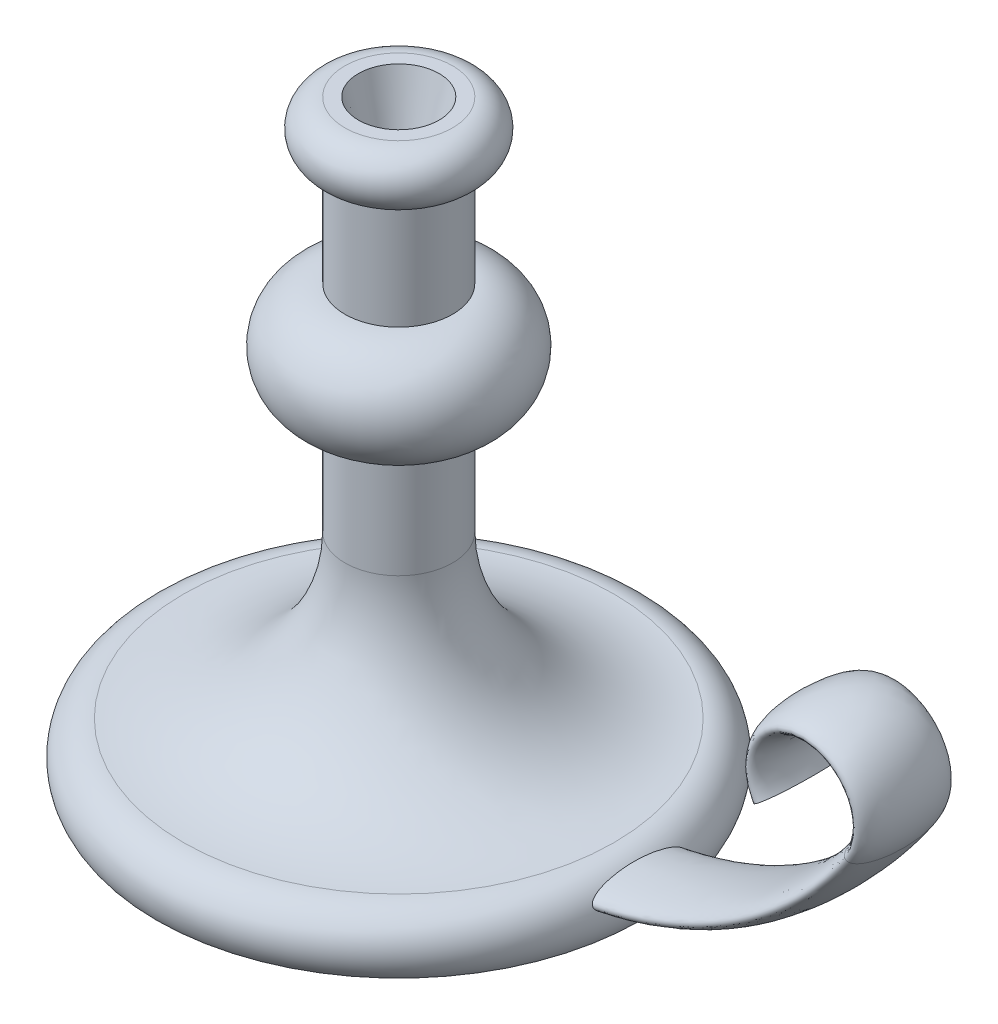
ISO-10303-21;
HEADER;
FILE_DESCRIPTION(('STEP AP214'),'2;1');
FILE_NAME('part.step','',(''),(''),'','','');
FILE_SCHEMA(('AUTOMOTIVE_DESIGN { 1 0 10303 214 1 1 1 1 }'));
ENDSEC;
DATA;
#1=APPLICATION_CONTEXT('core data for automotive mechanical design processes');
#2=APPLICATION_PROTOCOL_DEFINITION('international standard','automotive_design',2000,#1);
#3=PRODUCT_CONTEXT('',#1,'mechanical');
#4=PRODUCT('Part','Part','',(#3));
#5=PRODUCT_RELATED_PRODUCT_CATEGORY('part','',(#4));
#6=PRODUCT_DEFINITION_FORMATION('','',#4);
#7=PRODUCT_DEFINITION_CONTEXT('part definition',#1,'design');
#8=PRODUCT_DEFINITION('design','',#6,#7);
#9=PRODUCT_DEFINITION_SHAPE('','',#8);
#10=(LENGTH_UNIT() NAMED_UNIT(*) SI_UNIT(.MILLI.,.METRE.));
#11=(NAMED_UNIT(*) PLANE_ANGLE_UNIT() SI_UNIT($,.RADIAN.));
#12=(NAMED_UNIT(*) SI_UNIT($,.STERADIAN.) SOLID_ANGLE_UNIT());
#13=UNCERTAINTY_MEASURE_WITH_UNIT(LENGTH_MEASURE(1.E-05),#10,'distance_accuracy_value','');
#14=(GEOMETRIC_REPRESENTATION_CONTEXT(3) GLOBAL_UNCERTAINTY_ASSIGNED_CONTEXT((#13)) GLOBAL_UNIT_ASSIGNED_CONTEXT((#10,
#11,#12)) REPRESENTATION_CONTEXT('',''));
#15=CARTESIAN_POINT('',(0.,0.,0.));
#16=DIRECTION('',(0.,0.,1.));
#17=DIRECTION('',(1.,0.,0.));
#18=AXIS2_PLACEMENT_3D('',#15,#16,#17);
#19=CARTESIAN_POINT('',(0.,58.5,0.));
#20=DIRECTION('',(0.,1.,0.));
#21=DIRECTION('',(-1.,0.,0.));
#22=AXIS2_PLACEMENT_3D('',#19,#20,#21);
#23=TOROIDAL_SURFACE('',#22,20.,10.);
#24=CARTESIAN_POINT('',(0.,68.5,0.));
#25=DIRECTION('',(0.,1.,0.));
#26=DIRECTION('',(-1.,0.,0.));
#27=AXIS2_PLACEMENT_3D('',#24,#25,#26);
#28=CIRCLE('',#27,20.);
#29=CARTESIAN_POINT('',(-20.,68.5,0.));
#30=VERTEX_POINT('',#29);
#31=EDGE_CURVE('E11',#30,#30,#28,.T.);
#32=ORIENTED_EDGE('',*,*,#31,.F.);
#33=EDGE_LOOP('',(#32));
#34=FACE_BOUND('',#33,.T.);
#35=CARTESIAN_POINT('',(0.,48.5,0.));
#36=DIRECTION('',(0.,1.,0.));
#37=DIRECTION('',(-1.,0.,0.));
#38=AXIS2_PLACEMENT_3D('',#35,#36,#37);
#39=CIRCLE('',#38,20.);
#40=CARTESIAN_POINT('',(-20.,48.5,0.));
#41=VERTEX_POINT('',#40);
#42=EDGE_CURVE('E58',#41,#41,#39,.T.);
#43=ORIENTED_EDGE('',*,*,#42,.T.);
#44=EDGE_LOOP('',(#43));
#45=FACE_BOUND('',#44,.T.);
#46=ADVANCED_FACE('F37',(#34,#45),#23,.T.);
#47=CARTESIAN_POINT('',(20.,68.5,0.));
#48=DIRECTION('',(0.,-1.,0.));
#49=DIRECTION('',(1.,0.,0.));
#50=AXIS2_PLACEMENT_3D('',#47,#48,#49);
#51=PLANE('',#50);
#52=CARTESIAN_POINT('',(0.,68.5,0.));
#53=DIRECTION('',(0.,1.,0.));
#54=DIRECTION('',(-1.,0.,0.));
#55=AXIS2_PLACEMENT_3D('',#52,#53,#54);
#56=CIRCLE('',#55,15.);
#57=CARTESIAN_POINT('',(-15.,68.5,0.));
#58=VERTEX_POINT('',#57);
#59=EDGE_CURVE('E164',#58,#58,#56,.T.);
#60=ORIENTED_EDGE('',*,*,#59,.F.);
#61=EDGE_LOOP('',(#60));
#62=FACE_BOUND('',#61,.T.);
#63=ORIENTED_EDGE('',*,*,#31,.T.);
#64=EDGE_LOOP('',(#63));
#65=FACE_BOUND('',#64,.T.);
#66=ADVANCED_FACE('F86',(#62,#65),#51,.F.);
#67=CARTESIAN_POINT('',(0.,-151.5,0.));
#68=DIRECTION('',(0.,1.,0.));
#69=DIRECTION('',(-1.,0.,0.));
#70=AXIS2_PLACEMENT_3D('',#67,#68,#69);
#71=PLANE('',#70);
#72=CARTESIAN_POINT('',(0.,-151.5,0.));
#73=DIRECTION('',(0.,1.,0.));
#74=DIRECTION('',(-1.,0.,0.));
#75=AXIS2_PLACEMENT_3D('',#72,#73,#74);
#76=CIRCLE('',#75,90.);
#77=CARTESIAN_POINT('',(-90.,-151.5,0.));
#78=VERTEX_POINT('',#77);
#79=EDGE_CURVE('E48',#78,#78,#76,.T.);
#80=ORIENTED_EDGE('',*,*,#79,.F.);
#81=EDGE_LOOP('',(#80));
#82=FACE_BOUND('',#81,.T.);
#83=ADVANCED_FACE('F84',(#82),#71,.F.);
#84=CARTESIAN_POINT('',(0.,-144.,0.));
#85=DIRECTION('',(0.,1.,0.));
#86=DIRECTION('',(-1.,0.,0.));
#87=AXIS2_PLACEMENT_3D('',#84,#85,#86);
#88=TOROIDAL_SURFACE('',#87,80.,12.5);
#89=CARTESIAN_POINT('',(89.5597422043341,-138.558565343244,-17.5));
#90=CARTESIAN_POINT('',(89.5807278946485,-138.601160684292,-17.5000019534777));
#91=CARTESIAN_POINT('',(89.6018125795404,-138.643696064223,-17.4977816975197));
#92=CARTESIAN_POINT('',(89.6440155813562,-138.728306166063,-17.489002543543));
#93=CARTESIAN_POINT('',(89.6651339056646,-138.770380763928,-17.4824425050804));
#94=CARTESIAN_POINT('',(89.7283289297819,-138.895492340258,-17.4565216692095));
#95=CARTESIAN_POINT('',(89.7702246464785,-138.977374410574,-17.4309204730636));
#96=CARTESIAN_POINT('',(89.8644276523311,-139.159226422803,-17.3563532007827));
#97=CARTESIAN_POINT('',(89.9162117483189,-139.257515098334,-17.3027527423027));
#98=CARTESIAN_POINT('',(90.0163878681401,-139.444854172799,-17.178826321144));
#99=CARTESIAN_POINT('',(90.0647710548456,-139.533880773007,-17.1084587296403));
#100=CARTESIAN_POINT('',(90.1524531790238,-139.693015477075,-16.9652391551481));
#101=CARTESIAN_POINT('',(90.1921458014336,-139.764112100552,-16.8936963434586));
#102=CARTESIAN_POINT('',(90.2690886261224,-139.900374093178,-16.7438969488311));
#103=CARTESIAN_POINT('',(90.3063367280021,-139.965534379847,-16.665634722265));
#104=CARTESIAN_POINT('',(90.3786756485819,-140.090745918489,-16.5039763875564));
#105=CARTESIAN_POINT('',(90.4137624747614,-140.150787789371,-16.4205713158718));
#106=CARTESIAN_POINT('',(90.4819450166471,-140.26631059746,-16.2499454917114));
#107=CARTESIAN_POINT('',(90.5150413047902,-140.321792847617,-16.162725848809));
#108=CARTESIAN_POINT('',(90.5839705930101,-140.436274817431,-15.9728919395737));
#109=CARTESIAN_POINT('',(90.6195406839562,-140.494684387115,-15.8698282905888));
#110=CARTESIAN_POINT('',(90.6886668526269,-140.607085610279,-15.6606649910659));
#111=CARTESIAN_POINT('',(90.7222226971282,-140.661076752426,-15.5545649910506));
#112=CARTESIAN_POINT('',(90.787486486134,-140.765124859688,-15.3401290691865));
#113=CARTESIAN_POINT('',(90.8191972688173,-140.815187910916,-15.2317969483067));
#114=CARTESIAN_POINT('',(90.881005962979,-140.911931661459,-15.0131968985225));
#115=CARTESIAN_POINT('',(90.9111039714558,-140.958612564248,-14.9029290865687));
#116=CARTESIAN_POINT('',(90.9798973633521,-141.06445084829,-14.6427529331226));
#117=CARTESIAN_POINT('',(91.0180072010884,-141.122406334424,-14.4922012075481));
#118=CARTESIAN_POINT('',(91.0918875553169,-141.233653710831,-14.1888070722871));
#119=CARTESIAN_POINT('',(91.1276577411367,-141.286944942244,-14.0359643425398));
#120=CARTESIAN_POINT('',(91.1971197458645,-141.389487231039,-13.7282685712582));
#121=CARTESIAN_POINT('',(91.2308091946811,-141.43873370149,-13.5734134718711));
#122=CARTESIAN_POINT('',(91.2962483962878,-141.533579554252,-13.262180104172));
#123=CARTESIAN_POINT('',(91.3279980241889,-141.5791787018,-13.1058017385397));
#124=CARTESIAN_POINT('',(91.4205951755327,-141.711125413392,-12.6346162266686));
#125=CARTESIAN_POINT('',(91.4787589060981,-141.792575230204,-12.3179025042443));
#126=CARTESIAN_POINT('',(91.5890957852254,-141.945061738698,-11.6792188898602));
#127=CARTESIAN_POINT('',(91.641236506382,-142.016042585741,-11.357230318611));
#128=CARTESIAN_POINT('',(91.7397682682944,-142.148637788368,-10.7107316640824));
#129=CARTESIAN_POINT('',(91.7861636672357,-142.210259251768,-10.3862236929835));
#130=CARTESIAN_POINT('',(91.8736976604511,-142.325362816819,-9.73512886653582));
#131=CARTESIAN_POINT('',(91.9148370779327,-142.378846193335,-9.40854234516828));
#132=CARTESIAN_POINT('',(91.9930777751443,-142.479687900797,-8.74630339912627));
#133=CARTESIAN_POINT('',(92.0300669877613,-142.526880788628,-8.4106126926435));
#134=CARTESIAN_POINT('',(92.0991833927575,-142.614401575226,-7.73783252743958));
#135=CARTESIAN_POINT('',(92.1313104056235,-142.654729220532,-7.40074301754625));
#136=CARTESIAN_POINT('',(92.1909161961866,-142.729076865607,-6.72537142355359));
#137=CARTESIAN_POINT('',(92.2183937480206,-142.763095202108,-6.38708904887205));
#138=CARTESIAN_POINT('',(92.2688480816039,-142.825231596955,-5.70964427774304));
#139=CARTESIAN_POINT('',(92.2918247141674,-142.853349459728,-5.37048185250312));
#140=CARTESIAN_POINT('',(92.3540877228587,-142.929233953695,-4.35367181244682));
#141=CARTESIAN_POINT('',(92.3868571977359,-142.968716616294,-3.67498389641661));
#142=CARTESIAN_POINT('',(92.4356134743347,-143.027258381671,-2.31614711504086));
#143=CARTESIAN_POINT('',(92.4515998737813,-143.046316994903,-1.6359982150684));
#144=CARTESIAN_POINT('',(92.4661200478781,-143.063626607151,-0.357955102332095));
#145=CARTESIAN_POINT('',(92.4665389208555,-143.064125098203,0.239888856143528));
#146=CARTESIAN_POINT('',(92.4546362797529,-143.049937587392,1.43536153859156));
#147=CARTESIAN_POINT('',(92.4423128974783,-143.035249358942,2.03299021814836));
#148=CARTESIAN_POINT('',(92.4047541650815,-142.990233192201,3.22745109478542));
#149=CARTESIAN_POINT('',(92.379514731688,-142.959900307996,3.82428298010725));
#150=CARTESIAN_POINT('',(92.3157217367253,-142.882566797703,5.01694606233267));
#151=CARTESIAN_POINT('',(92.2771508465328,-142.835544476041,5.61277493756139));
#152=CARTESIAN_POINT('',(92.1861026743767,-142.723212157537,6.80153886380954));
#153=CARTESIAN_POINT('',(92.1336290020919,-142.657906907375,7.39447462535108));
#154=CARTESIAN_POINT('',(92.0437550848418,-142.544257727933,8.28055229820534));
#155=CARTESIAN_POINT('',(92.0119455213755,-142.50377105448,8.57528682166749));
#156=CARTESIAN_POINT('',(91.9444204496405,-142.417084602051,9.1634609442891));
#157=CARTESIAN_POINT('',(91.9087051114865,-142.370885071885,9.45690059926742));
#158=CARTESIAN_POINT('',(91.8331309715697,-142.272170706659,10.0422906036686));
#159=CARTESIAN_POINT('',(91.7932707518514,-142.219653709436,10.3342404073471));
#160=CARTESIAN_POINT('',(91.7091179167369,-142.107549379184,10.9161852811056));
#161=CARTESIAN_POINT('',(91.6648247441272,-142.04796115714,11.2061801005456));
#162=CARTESIAN_POINT('',(91.571392572748,-141.920683546661,11.7838191658172));
#163=CARTESIAN_POINT('',(91.5222504482681,-141.852988926631,12.0714617643076));
#164=CARTESIAN_POINT('',(91.4186796874405,-141.708272699141,12.6430805537635));
#165=CARTESIAN_POINT('',(91.3642572573634,-141.631262015759,12.9270606150359));
#166=CARTESIAN_POINT('',(91.2493765391174,-141.466047025212,13.490421718147));
#167=CARTESIAN_POINT('',(91.1889212109096,-141.377848201655,13.7698049377452));
#168=CARTESIAN_POINT('',(91.0929373870873,-141.235172511764,14.1839125047651));
#169=CARTESIAN_POINT('',(91.0600757486261,-141.185909581815,14.3210581267391));
#170=CARTESIAN_POINT('',(90.9923938569385,-141.083448897281,14.5933763477653));
#171=CARTESIAN_POINT('',(90.9575737807135,-141.030251498152,14.7285491237349));
#172=CARTESIAN_POINT('',(90.8810851838776,-140.912154865592,15.0138774923682));
#173=CARTESIAN_POINT('',(90.8391147723956,-140.846633379159,15.1636969104752));
#174=CARTESIAN_POINT('',(90.7519625692611,-140.708781022818,15.4593295355903));
#175=CARTESIAN_POINT('',(90.7067794219568,-140.636447274169,15.6051410149851));
#176=CARTESIAN_POINT('',(90.6128939496974,-140.483956037032,15.8905749729624));
#177=CARTESIAN_POINT('',(90.564208454431,-140.403835389431,16.0302224467126));
#178=CARTESIAN_POINT('',(90.4624897667354,-140.233746989213,16.3016394850687));
#179=CARTESIAN_POINT('',(90.4094613083908,-140.143789923932,16.4334173639363));
#180=CARTESIAN_POINT('',(90.3114276481006,-139.974491461495,16.6553108138958));
#181=CARTESIAN_POINT('',(90.2675273757818,-139.897739110939,16.7478644471359));
#182=CARTESIAN_POINT('',(90.1761749534326,-139.735670776131,16.9236630994732));
#183=CARTESIAN_POINT('',(90.1287172073378,-139.650341224507,17.0068929161981));
#184=CARTESIAN_POINT('',(90.0292807633426,-139.468670820263,17.160728121925));
#185=CARTESIAN_POINT('',(89.9772518064337,-139.372202559265,17.2311575389092));
#186=CARTESIAN_POINT('',(89.8965437818878,-139.219938601206,17.3212876850736));
#187=CARTESIAN_POINT('',(89.8692277989252,-139.167983584686,17.3487242132162));
#188=CARTESIAN_POINT('',(89.8138320311431,-139.061704483152,17.397521114568));
#189=CARTESIAN_POINT('',(89.7857527202502,-139.00738185602,17.4188851676711));
#190=CARTESIAN_POINT('',(89.7185869780335,-138.87629519944,17.4611772226903));
#191=CARTESIAN_POINT('',(89.6792533408886,-138.798630777572,17.4790502108364));
#192=CARTESIAN_POINT('',(89.6005512815563,-138.641374366051,17.4997317533413));
#193=CARTESIAN_POINT('',(89.5611829132232,-138.561783986005,17.5025524785485));
#194=CARTESIAN_POINT('',(89.4835317885696,-138.403036657675,17.4927372657774));
#195=CARTESIAN_POINT('',(89.4452490812936,-138.323879729103,17.48010063065));
#196=CARTESIAN_POINT('',(89.3707047667354,-138.168192822544,17.440649407729));
#197=CARTESIAN_POINT('',(89.3344452993771,-138.091665657647,17.4138201116179));
#198=CARTESIAN_POINT('',(89.2510611220234,-137.914144561432,17.3357126521072));
#199=CARTESIAN_POINT('',(89.2050998650831,-137.815017622278,17.279004762084));
#200=CARTESIAN_POINT('',(89.1180744174556,-137.625572368818,17.1491670423825));
#201=CARTESIAN_POINT('',(89.0770301058258,-137.535290064331,17.0759737821297));
#202=CARTESIAN_POINT('',(89.003703374471,-137.372856514243,16.9270577307037));
#203=CARTESIAN_POINT('',(88.9709541551902,-137.299805431927,16.8525208708984));
#204=CARTESIAN_POINT('',(88.9084968426189,-137.159818830955,16.6970292692108));
#205=CARTESIAN_POINT('',(88.8787841266133,-137.092874033423,16.616084626189));
#206=CARTESIAN_POINT('',(88.8217814388548,-136.964000436911,16.4490709627675));
#207=CARTESIAN_POINT('',(88.7944998605825,-136.902089075759,16.3629857823207));
#208=CARTESIAN_POINT('',(88.7420667437368,-136.782826593534,16.1870697873627));
#209=CARTESIAN_POINT('',(88.7169159331091,-136.72547703134,16.0972377082946));
#210=CARTESIAN_POINT('',(88.6682699235335,-136.614410090948,15.9140699306458));
#211=CARTESIAN_POINT('',(88.6447869137155,-136.560719551057,15.8207148279054));
#212=CARTESIAN_POINT('',(88.5993971939426,-136.456899115611,15.6316626961427));
#213=CARTESIAN_POINT('',(88.5774907604156,-136.40676984449,15.5359652603518));
#214=CARTESIAN_POINT('',(88.5137514786218,-136.260971412581,15.245806244878));
#215=CARTESIAN_POINT('',(88.4739596847911,-136.170031452264,15.048514720784));
#216=CARTESIAN_POINT('',(88.3985337506613,-135.998222479637,14.6487152633379));
#217=CARTESIAN_POINT('',(88.3629029634838,-135.917361585996,14.4462032813464));
#218=CARTESIAN_POINT('',(88.294835671121,-135.763693387132,14.0365764701678));
#219=CARTESIAN_POINT('',(88.2624142295167,-135.690923880018,13.8294450545338));
#220=CARTESIAN_POINT('',(88.2003835751379,-135.552635119804,13.4126289871747));
#221=CARTESIAN_POINT('',(88.1707714189811,-135.487108266177,13.2029472733568));
#222=CARTESIAN_POINT('',(88.1139049361935,-135.362262425437,12.7814949946285));
#223=CARTESIAN_POINT('',(88.0866500408506,-135.302941940249,12.5697249473611));
#224=CARTESIAN_POINT('',(88.0276172572028,-135.175576433769,12.0912931700759));
#225=CARTESIAN_POINT('',(87.9964138193042,-135.10906187345,11.8241540502324));
#226=CARTESIAN_POINT('',(87.9367717636615,-134.983406323528,11.2878278414627));
#227=CARTESIAN_POINT('',(87.9083334164419,-134.924266055233,11.018640554925));
#228=CARTESIAN_POINT('',(87.853926628297,-134.812490105104,10.4785408424857));
#229=CARTESIAN_POINT('',(87.8279593730485,-134.7598575422,10.2076276543167));
#230=CARTESIAN_POINT('',(87.7783184309329,-134.660469847706,9.66451167999545));
#231=CARTESIAN_POINT('',(87.7546448506394,-134.613714989188,9.39230883453631));
#232=CARTESIAN_POINT('',(87.6869994555323,-134.481719694905,8.57578965921468));
#233=CARTESIAN_POINT('',(87.6462388525844,-134.404414599631,8.02991167225116));
#234=CARTESIAN_POINT('',(87.5728065515609,-134.267985431269,6.93552385093627));
#235=CARTESIAN_POINT('',(87.540133067568,-134.208857343367,6.38701462497697));
#236=CARTESIAN_POINT('',(87.4828441952969,-134.106912387902,5.28955884850476));
#237=CARTESIAN_POINT('',(87.4582074588679,-134.064052257067,4.74061740412112));
#238=CARTESIAN_POINT('',(87.416941099917,-133.99311150653,3.64146108218268));
#239=CARTESIAN_POINT('',(87.4003119088601,-133.965031683216,3.09124613761343));
#240=CARTESIAN_POINT('',(87.3751699481988,-133.922843353797,1.9898086896874));
#241=CARTESIAN_POINT('',(87.3666614689743,-133.908742232847,1.43858580771637));
#242=CARTESIAN_POINT('',(87.3578539704596,-133.89414881594,0.335909067640385));
#243=CARTESIAN_POINT('',(87.3575547550008,-133.893656194796,-0.215544784630398));
#244=CARTESIAN_POINT('',(87.3651677510509,-133.906264783749,-1.3181582277678));
#245=CARTESIAN_POINT('',(87.3730787250644,-133.919363945201,-1.86931785045645));
#246=CARTESIAN_POINT('',(87.3970372477744,-133.959513170726,-2.97097544678305));
#247=CARTESIAN_POINT('',(87.413085065354,-133.986563695824,-3.52147339795334));
#248=CARTESIAN_POINT('',(87.4531996813084,-134.055378617243,-4.62112135667417));
#249=CARTESIAN_POINT('',(87.4772644593795,-134.097139306699,-5.17027166874783));
#250=CARTESIAN_POINT('',(87.5333316774065,-134.196629238728,-6.26670053624201));
#251=CARTESIAN_POINT('',(87.5653334299487,-134.254357098449,-6.81397924960065));
#252=CARTESIAN_POINT('',(87.6208220531236,-134.357095049092,-7.65503321384444));
#253=CARTESIAN_POINT('',(87.6414679669265,-134.395766675327,-7.94978028809553));
#254=CARTESIAN_POINT('',(87.6851649593461,-134.478774929846,-8.53829462762855));
#255=CARTESIAN_POINT('',(87.7082159678756,-134.523111393058,-8.83206192120513));
#256=CARTESIAN_POINT('',(87.7568106691343,-134.617948963033,-9.41827197237469));
#257=CARTESIAN_POINT('',(87.7823533406007,-134.668447546227,-9.71071522165399));
#258=CARTESIAN_POINT('',(87.8360989952271,-134.776280631896,-10.2940938312804));
#259=CARTESIAN_POINT('',(87.8643018909562,-134.833614909727,-10.5850292408528));
#260=CARTESIAN_POINT('',(87.9147712499553,-134.937715738951,-11.0784529887273));
#261=CARTESIAN_POINT('',(87.9362980252959,-134.982530810022,-11.2814293835382));
#262=CARTESIAN_POINT('',(87.9809118301309,-135.076316486526,-11.6862455623121));
#263=CARTESIAN_POINT('',(88.0039988123358,-135.125286966021,-11.8880853805235));
#264=CARTESIAN_POINT('',(88.0519198244948,-135.227878461525,-12.2905621648885));
#265=CARTESIAN_POINT('',(88.0767553337328,-135.281503424458,-12.4911979528453));
#266=CARTESIAN_POINT('',(88.1283787004672,-135.393929215267,-12.8907612736874));
#267=CARTESIAN_POINT('',(88.1551664933028,-135.452729871735,-13.0896888629055));
#268=CARTESIAN_POINT('',(88.2109999780509,-135.576228179443,-13.4854201231444));
#269=CARTESIAN_POINT('',(88.2400459194863,-135.640926482505,-13.6822235567042));
#270=CARTESIAN_POINT('',(88.3008027999437,-135.777130806416,-14.0730419872928));
#271=CARTESIAN_POINT('',(88.332513477959,-135.848636160617,-14.2670572552431));
#272=CARTESIAN_POINT('',(88.3991424541966,-135.999605188415,-14.6511973591167));
#273=CARTESIAN_POINT('',(88.4340575115822,-136.079060828459,-14.8413258930689));
#274=CARTESIAN_POINT('',(88.5079196083054,-136.247615123745,-15.2164401400197));
#275=CARTESIAN_POINT('',(88.5468648114136,-136.336709388236,-15.4014281468518));
#276=CARTESIAN_POINT('',(88.6092096238857,-136.479342028114,-15.6733114229668));
#277=CARTESIAN_POINT('',(88.6306485895107,-136.528391325999,-15.7630166800394));
#278=CARTESIAN_POINT('',(88.6750422753317,-136.629875138479,-15.9401002079393));
#279=CARTESIAN_POINT('',(88.6979967332502,-136.682309067281,-16.0274788777617));
#280=CARTESIAN_POINT('',(88.7456840101804,-136.791052115574,-16.1993887567148));
#281=CARTESIAN_POINT('',(88.7704179688275,-136.847363717412,-16.2839180892556));
#282=CARTESIAN_POINT('',(88.8219484857483,-136.96435773821,-16.4492391224763));
#283=CARTESIAN_POINT('',(88.8487445345051,-137.025039077226,-16.5300317386038));
#284=CARTESIAN_POINT('',(88.897610278819,-137.135256515106,-16.6667168433057));
#285=CARTESIAN_POINT('',(88.9191374191613,-137.183676967793,-16.7236955334952));
#286=CARTESIAN_POINT('',(88.9637080676472,-137.283554701785,-16.834291280268));
#287=CARTESIAN_POINT('',(88.9867519478517,-137.335012727894,-16.8879075056824));
#288=CARTESIAN_POINT('',(89.0583610181504,-137.494199178321,-17.0423310846562));
#289=CARTESIAN_POINT('',(89.1095289234108,-137.607024158305,-17.1370796109731));
#290=CARTESIAN_POINT('',(89.1999001554579,-137.803661379103,-17.270795618467));
#291=CARTESIAN_POINT('',(89.2367505169326,-137.883235512033,-17.3175503480635));
#292=CARTESIAN_POINT('',(89.3136877653855,-138.0477025834,-17.396846873719));
#293=CARTESIAN_POINT('',(89.3537667767871,-138.132582472604,-17.4294220837184));
#294=CARTESIAN_POINT('',(89.4217091217897,-138.274815102647,-17.4685967336685));
#295=CARTESIAN_POINT('',(89.4488093840983,-138.331144828383,-17.4803204652977));
#296=CARTESIAN_POINT('',(89.503794774035,-138.444540506503,-17.4960211898048));
#297=CARTESIAN_POINT('',(89.5316799819,-138.501606533826,-17.499997387795));
#298=CARTESIAN_POINT('',(89.5597422043341,-138.558565343244,-17.5));
#299=B_SPLINE_CURVE_WITH_KNOTS('',3,(#89,#90,#91,#92,#93,#94,#95,#96,#97,#98,#99,#100,#101,#102,
#103,#104,#105,#106,#107,#108,#109,#110,#111,#112,#113,#114,#115,#116,#117,#118,#119,#120,#121,
#122,#123,#124,#125,#126,#127,#128,#129,#130,#131,#132,#133,#134,#135,#136,#137,#138,#139,#140,
#141,#142,#143,#144,#145,#146,#147,#148,#149,#150,#151,#152,#153,#154,#155,#156,#157,#158,#159,
#160,#161,#162,#163,#164,#165,#166,#167,#168,#169,#170,#171,#172,#173,#174,#175,#176,#177,#178,
#179,#180,#181,#182,#183,#184,#185,#186,#187,#188,#189,#190,#191,#192,#193,#194,#195,#196,#197,
#198,#199,#200,#201,#202,#203,#204,#205,#206,#207,#208,#209,#210,#211,#212,#213,#214,#215,#216,
#217,#218,#219,#220,#221,#222,#223,#224,#225,#226,#227,#228,#229,#230,#231,#232,#233,#234,#235,
#236,#237,#238,#239,#240,#241,#242,#243,#244,#245,#246,#247,#248,#249,#250,#251,#252,#253,#254,
#255,#256,#257,#258,#259,#260,#261,#262,#263,#264,#265,#266,#267,#268,#269,#270,#271,#272,#273,
#274,#275,#276,#277,#278,#279,#280,#281,#282,#283,#284,#285,#286,#287,#288,#289,#290,#291,#292,
#293,#294,#295,#296,#297,#298),.UNSPECIFIED.,.T.,.F.,(4,2,2,2,2,2,2,2,2,2,2,2,2,2,2,2,2,2,2,2,2,
2,2,2,2,2,2,2,2,2,2,2,2,2,2,2,2,2,2,2,2,2,2,2,2,2,2,2,2,2,2,2,2,2,2,2,2,2,2,2,2,2,2,2,2,2,2,2,2,
2,2,2,2,2,2,2,2,2,2,2,2,2,2,2,2,2,2,2,2,2,2,2,2,2,2,2,2,2,2,2,2,2,2,2,4),(0.,0.142381357158806,
0.28480014533879,0.569778369710357,0.937790990160518,1.30672699797602,1.63143353328553,
1.95641550824172,2.28198085179476,2.60745211744531,2.97835758825749,3.34930592253144,
3.71966767593577,4.09000712931066,4.58717127025775,5.08440552627601,5.58219609730417,
6.080018683222,7.07612740491143,8.07737111401411,9.0778506032847,10.0781732018629,
11.1010679437461,12.1240004418368,13.1472022244406,14.1704379160042,16.2117115539473,
18.2530341182271,20.0462457692418,21.839720367684,23.6337623045227,25.4301450150666,
27.2260617741977,28.123589229418,29.0210776087007,29.9188740333851,30.8167834514326,
31.7152755049925,32.6127240115723,33.5097343419009,33.957824727082,34.4058746792334,
34.9121604747942,35.4186611861171,35.9228725276492,36.4265413835618,36.8100240505595,
37.19412315042,37.5831580539594,37.7772586450043,37.971241359917,38.2366258142319,
38.5017956533802,38.7669774525072,39.032434608115,39.3996555983551,39.7683144393125,
40.0959866375244,40.4231523204133,40.7514069982218,41.0797733710083,41.4103344436387,
41.7409533344662,42.4030339566281,43.0656444835745,43.7312306850966,44.3961116446172,
45.0608317450522,45.89186085531,46.7229711882524,47.5544783139783,48.3860240564179,
50.0440426041209,51.7016946763049,53.3549069476228,55.0082082878498,56.6623826267386,
58.3165174374234,59.9704029618982,61.6243431428267,63.2778668395703,64.9312473761742,
65.8251617717475,66.7190501248756,67.6125736254269,68.506067769689,69.1329546330716,
69.7598225042339,70.3872272415133,71.014611208225,71.6420645989549,72.2694566030693,
72.8962209263483,73.5227009279547,73.8360175198419,74.1492800292319,74.462744976661,
74.7761327179502,75.0094189443202,75.2427626113353,75.708018639223,76.0052441465124,
76.3017654013251,76.4921392885524,76.6825327068869),.UNSPECIFIED.);
#300=CARTESIAN_POINT('',(89.5597422043341,-138.558565343244,-17.5));
#301=VERTEX_POINT('',#300);
#302=EDGE_CURVE('E40',#301,#301,#299,.T.);
#303=ORIENTED_EDGE('',*,*,#302,.T.);
#304=EDGE_LOOP('',(#303));
#305=FACE_BOUND('',#304,.T.);
#306=CARTESIAN_POINT('',(0.,-131.5,0.));
#307=DIRECTION('',(0.,1.,0.));
#308=DIRECTION('',(-1.,0.,0.));
#309=AXIS2_PLACEMENT_3D('',#306,#307,#308);
#310=CIRCLE('',#309,80.);
#311=CARTESIAN_POINT('',(-80.,-131.5,0.));
#312=VERTEX_POINT('',#311);
#313=EDGE_CURVE('E76',#312,#312,#310,.T.);
#314=ORIENTED_EDGE('',*,*,#313,.F.);
#315=EDGE_LOOP('',(#314));
#316=FACE_BOUND('',#315,.T.);
#317=ORIENTED_EDGE('',*,*,#79,.T.);
#318=EDGE_LOOP('',(#317));
#319=FACE_BOUND('',#318,.T.);
#320=ADVANCED_FACE('F82',(#305,#316,#319),#88,.T.);
#321=CARTESIAN_POINT('',(0.,-71.5,0.));
#322=DIRECTION('',(0.,1.,0.));
#323=DIRECTION('',(-1.,0.,0.));
#324=AXIS2_PLACEMENT_3D('',#321,#322,#323);
#325=TOROIDAL_SURFACE('',#324,80.,60.);
#326=CARTESIAN_POINT('',(0.,-71.5,0.));
#327=DIRECTION('',(0.,1.,0.));
#328=DIRECTION('',(-1.,0.,0.));
#329=AXIS2_PLACEMENT_3D('',#326,#327,#328);
#330=CIRCLE('',#329,20.);
#331=CARTESIAN_POINT('',(-20.,-71.5,0.));
#332=VERTEX_POINT('',#331);
#333=EDGE_CURVE('E72',#332,#332,#330,.T.);
#334=ORIENTED_EDGE('',*,*,#333,.F.);
#335=EDGE_LOOP('',(#334));
#336=FACE_BOUND('',#335,.T.);
#337=ORIENTED_EDGE('',*,*,#313,.T.);
#338=EDGE_LOOP('',(#337));
#339=FACE_BOUND('',#338,.T.);
#340=ADVANCED_FACE('F92',(#336,#339),#325,.F.);
#341=CARTESIAN_POINT('',(0.,68.5,0.));
#342=DIRECTION('',(0.,1.,0.));
#343=DIRECTION('',(-1.,0.,0.));
#344=AXIS2_PLACEMENT_3D('',#341,#342,#343);
#345=CYLINDRICAL_SURFACE('',#344,20.);
#346=CARTESIAN_POINT('',(0.,-31.5,0.));
#347=DIRECTION('',(0.,1.,0.));
#348=DIRECTION('',(-1.,0.,0.));
#349=AXIS2_PLACEMENT_3D('',#346,#347,#348);
#350=CIRCLE('',#349,20.);
#351=CARTESIAN_POINT('',(-20.,-31.5,0.));
#352=VERTEX_POINT('',#351);
#353=EDGE_CURVE('E69',#352,#352,#350,.T.);
#354=ORIENTED_EDGE('',*,*,#353,.F.);
#355=EDGE_LOOP('',(#354));
#356=FACE_BOUND('',#355,.T.);
#357=ORIENTED_EDGE('',*,*,#333,.T.);
#358=EDGE_LOOP('',(#357));
#359=FACE_BOUND('',#358,.T.);
#360=ADVANCED_FACE('F113',(#356,#359),#345,.T.);
#361=CARTESIAN_POINT('',(0.,-11.5,0.));
#362=DIRECTION('',(0.,1.,0.));
#363=DIRECTION('',(-1.,0.,0.));
#364=AXIS2_PLACEMENT_3D('',#361,#362,#363);
#365=TOROIDAL_SURFACE('',#364,20.,20.);
#366=CARTESIAN_POINT('',(0.,8.49999999999997,0.));
#367=DIRECTION('',(0.,1.,0.));
#368=DIRECTION('',(-1.,0.,0.));
#369=AXIS2_PLACEMENT_3D('',#366,#367,#368);
#370=CIRCLE('',#369,20.);
#371=CARTESIAN_POINT('',(-20.,8.49999999999997,0.));
#372=VERTEX_POINT('',#371);
#373=EDGE_CURVE('E66',#372,#372,#370,.T.);
#374=ORIENTED_EDGE('',*,*,#373,.F.);
#375=EDGE_LOOP('',(#374));
#376=FACE_BOUND('',#375,.T.);
#377=ORIENTED_EDGE('',*,*,#353,.T.);
#378=EDGE_LOOP('',(#377));
#379=FACE_BOUND('',#378,.T.);
#380=ADVANCED_FACE('F107',(#376,#379),#365,.T.);
#381=CARTESIAN_POINT('',(0.,68.5,0.));
#382=DIRECTION('',(0.,1.,0.));
#383=DIRECTION('',(-1.,0.,0.));
#384=AXIS2_PLACEMENT_3D('',#381,#382,#383);
#385=CYLINDRICAL_SURFACE('',#384,20.);
#386=ORIENTED_EDGE('',*,*,#42,.F.);
#387=EDGE_LOOP('',(#386));
#388=FACE_BOUND('',#387,.T.);
#389=ORIENTED_EDGE('',*,*,#373,.T.);
#390=EDGE_LOOP('',(#389));
#391=FACE_BOUND('',#390,.T.);
#392=ADVANCED_FACE('F103',(#388,#391),#385,.T.);
#393=CARTESIAN_POINT('',(60.,-141.5,-17.5));
#394=CARTESIAN_POINT('',(110.410191303973,-141.5,-17.5));
#395=CARTESIAN_POINT('',(155.026295870831,-118.035332932634,-17.5));
#396=CARTESIAN_POINT('',(183.592070943083,-76.5000000000001,-17.5));
#397=CARTESIAN_POINT('',(60.,-131.5,-17.5));
#398=CARTESIAN_POINT('',(107.049511883708,-131.5,-17.5));
#399=CARTESIAN_POINT('',(148.691209479443,-109.599644070458,-17.5));
#400=CARTESIAN_POINT('',(175.352599546877,-70.8333333333334,-17.5));
#401=CARTESIAN_POINT('',(60.,-131.5,17.5));
#402=CARTESIAN_POINT('',(107.049511883708,-131.5,17.5));
#403=CARTESIAN_POINT('',(148.691209479443,-109.599644070458,17.5));
#404=CARTESIAN_POINT('',(175.352599546877,-70.8333333333334,17.5));
#405=CARTESIAN_POINT('',(60.,-141.5,17.5));
#406=CARTESIAN_POINT('',(110.410191303973,-141.5,17.5));
#407=CARTESIAN_POINT('',(155.026295870831,-118.035332932634,17.5));
#408=CARTESIAN_POINT('',(183.592070943083,-76.5000000000001,17.5));
#409=CARTESIAN_POINT('',(60.,-151.5,17.5));
#410=CARTESIAN_POINT('',(113.770870724238,-151.5,17.5));
#411=CARTESIAN_POINT('',(161.36138226222,-126.471021794809,17.5));
#412=CARTESIAN_POINT('',(191.831542339288,-82.1666666666667,17.5));
#413=CARTESIAN_POINT('',(60.,-151.5,-17.5));
#414=CARTESIAN_POINT('',(113.770870724238,-151.5,-17.5));
#415=CARTESIAN_POINT('',(161.36138226222,-126.471021794809,-17.5));
#416=CARTESIAN_POINT('',(191.831542339288,-82.1666666666667,-17.5));
#417=CARTESIAN_POINT('',(60.,-141.5,-17.5));
#418=CARTESIAN_POINT('',(110.410191303973,-141.5,-17.5));
#419=CARTESIAN_POINT('',(155.026295870831,-118.035332932634,-17.5));
#420=CARTESIAN_POINT('',(183.592070943083,-76.5000000000001,-17.5));
#421=(BOUNDED_SURFACE() B_SPLINE_SURFACE(3,3,((#393,#394,#395,#396),(#397,#398,#399,#400),(#401,
#402,#403,#404),(#405,#406,#407,#408),(#409,#410,#411,#412),(#413,#414,#415,#416),(#417,#418,
#419,#420)),.UNSPECIFIED.,.T.,.F.,.F.) B_SPLINE_SURFACE_WITH_KNOTS((4,3,4),(4,4),(0.,0.5,1.),
(0.,1.),.UNSPECIFIED.) GEOMETRIC_REPRESENTATION_ITEM() RATIONAL_B_SPLINE_SURFACE(((1.,
0.923374135437856,0.923374135437856,1.),(0.333333333333333,0.307791378479285,0.307791378479285,
0.333333333333333),(0.333333333333333,0.307791378479285,0.307791378479285,0.333333333333333),
(1.,0.923374135437856,0.923374135437856,1.),(0.333333333333333,0.307791378479285,
0.307791378479285,0.333333333333333),(0.333333333333333,0.307791378479285,0.307791378479285,
0.333333333333333),(1.,0.923374135437856,0.923374135437856,1.))) REPRESENTATION_ITEM('') SURFACE());
#422=CARTESIAN_POINT('',(183.592070943083,-76.5000000000001,0.));
#423=DIRECTION('',(0.566666666666667,0.823947139620552,0.));
#424=DIRECTION('',(0.,0.,-1.));
#425=AXIS2_PLACEMENT_3D('',#422,#423,#424);
#426=ELLIPSE('',#425,17.5,5.);
#427=CARTESIAN_POINT('',(183.592070943083,-76.5000000000001,-17.5));
#428=VERTEX_POINT('',#427);
#429=EDGE_CURVE('E55',#428,#428,#426,.T.);
#430=ORIENTED_EDGE('',*,*,#429,.F.);
#431=EDGE_LOOP('',(#430));
#432=FACE_BOUND('',#431,.T.);
#433=ORIENTED_EDGE('',*,*,#302,.F.);
#434=EDGE_LOOP('',(#433));
#435=FACE_BOUND('',#434,.T.);
#436=ADVANCED_FACE('F106',(#432,#435),#421,.T.);
#437=CARTESIAN_POINT('',(149.87788457658,-75.3129161679219,0.));
#438=DIRECTION('',(0.507312475062765,-0.861762178704596,0.));
#439=DIRECTION('',(0.,0.,-1.));
#440=AXIS2_PLACEMENT_3D('',#437,#438,#439);
#441=PLANE('',#440);
#442=CARTESIAN_POINT('',(149.87788457658,-75.3129161679219,0.));
#443=DIRECTION('',(0.507312475062765,-0.861762178704596,0.));
#444=DIRECTION('',(0.,0.,-1.));
#445=AXIS2_PLACEMENT_3D('',#442,#443,#444);
#446=ELLIPSE('',#445,17.5,5.);
#447=CARTESIAN_POINT('',(149.87788457658,-75.3129161679219,-17.5));
#448=VERTEX_POINT('',#447);
#449=EDGE_CURVE('E52',#448,#448,#446,.T.);
#450=ORIENTED_EDGE('',*,*,#449,.T.);
#451=EDGE_LOOP('',(#450));
#452=FACE_BOUND('',#451,.T.);
#453=ADVANCED_FACE('F53',(#452),#441,.T.);
#454=CARTESIAN_POINT('',(183.592070943083,-76.5000000000001,-17.5));
#455=CARTESIAN_POINT('',(193.721065269658,-61.7721954659747,-17.5));
#456=CARTESIAN_POINT('',(185.680522383676,-45.8080349005413,-17.5));
#457=CARTESIAN_POINT('',(167.816896382541,-45.1790527451449,-17.5));
#458=CARTESIAN_POINT('',(149.953270381405,-44.5500705897485,-17.5));
#459=CARTESIAN_POINT('',(140.809828373559,-59.9091793109409,-17.5));
#460=CARTESIAN_POINT('',(149.87788457658,-75.3129161679219,-17.5));
#461=CARTESIAN_POINT('',(175.352599546877,-70.8333333333334,-17.5));
#462=CARTESIAN_POINT('',(180.417096710165,-63.4694310663207,-17.5));
#463=CARTESIAN_POINT('',(176.396825267174,-55.487350783604,-17.5));
#464=CARTESIAN_POINT('',(167.465012266606,-55.1728597059058,-17.5));
#465=CARTESIAN_POINT('',(158.533199266039,-54.8583686282076,-17.5));
#466=CARTESIAN_POINT('',(153.961478262116,-62.5379229888038,-17.5));
#467=CARTESIAN_POINT('',(158.495506363626,-70.2397914172943,-17.5));
#468=CARTESIAN_POINT('',(175.352599546877,-70.8333333333334,17.5));
#469=CARTESIAN_POINT('',(180.417096710165,-63.4694310663207,17.5));
#470=CARTESIAN_POINT('',(176.396825267174,-55.487350783604,17.5));
#471=CARTESIAN_POINT('',(167.465012266606,-55.1728597059058,17.5));
#472=CARTESIAN_POINT('',(158.533199266039,-54.8583686282076,17.5));
#473=CARTESIAN_POINT('',(153.961478262116,-62.5379229888038,17.5));
#474=CARTESIAN_POINT('',(158.495506363626,-70.2397914172943,17.5));
#475=CARTESIAN_POINT('',(183.592070943083,-76.5000000000001,17.5));
#476=CARTESIAN_POINT('',(193.721065269658,-61.7721954659747,17.5));
#477=CARTESIAN_POINT('',(185.680522383676,-45.8080349005413,17.5));
#478=CARTESIAN_POINT('',(167.816896382541,-45.1790527451449,17.5));
#479=CARTESIAN_POINT('',(149.953270381405,-44.5500705897485,17.5));
#480=CARTESIAN_POINT('',(140.809828373559,-59.9091793109409,17.5));
#481=CARTESIAN_POINT('',(149.87788457658,-75.3129161679219,17.5));
#482=CARTESIAN_POINT('',(191.831542339288,-82.1666666666667,17.5));
#483=CARTESIAN_POINT('',(207.025033829151,-60.0749598656287,17.5));
#484=CARTESIAN_POINT('',(194.964219500179,-36.1287190174785,17.5));
#485=CARTESIAN_POINT('',(168.168780498475,-35.185245784384,17.5));
#486=CARTESIAN_POINT('',(141.373341496772,-34.2417725512894,17.5));
#487=CARTESIAN_POINT('',(127.658178485003,-57.2804356330781,17.5));
#488=CARTESIAN_POINT('',(141.260262789534,-80.3860409185496,17.5));
#489=CARTESIAN_POINT('',(191.831542339288,-82.1666666666667,-17.5));
#490=CARTESIAN_POINT('',(207.025033829151,-60.0749598656287,-17.5));
#491=CARTESIAN_POINT('',(194.964219500179,-36.1287190174785,-17.5));
#492=CARTESIAN_POINT('',(168.168780498475,-35.185245784384,-17.5));
#493=CARTESIAN_POINT('',(141.373341496772,-34.2417725512894,-17.5));
#494=CARTESIAN_POINT('',(127.658178485003,-57.2804356330781,-17.5));
#495=CARTESIAN_POINT('',(141.260262789534,-80.3860409185496,-17.5));
#496=CARTESIAN_POINT('',(183.592070943083,-76.5000000000001,-17.5));
#497=CARTESIAN_POINT('',(193.721065269658,-61.7721954659747,-17.5));
#498=CARTESIAN_POINT('',(185.680522383676,-45.8080349005413,-17.5));
#499=CARTESIAN_POINT('',(167.816896382541,-45.1790527451449,-17.5));
#500=CARTESIAN_POINT('',(149.953270381405,-44.5500705897485,-17.5));
#501=CARTESIAN_POINT('',(140.809828373559,-59.9091793109409,-17.5));
#502=CARTESIAN_POINT('',(149.87788457658,-75.3129161679219,-17.5));
#503=(BOUNDED_SURFACE() B_SPLINE_SURFACE(3,3,((#454,#455,#456,#457,#458,#459,#460),(#461,#462,
#463,#464,#465,#466,#467),(#468,#469,#470,#471,#472,#473,#474),(#475,#476,#477,#478,#479,#480,
#481),(#482,#483,#484,#485,#486,#487,#488),(#489,#490,#491,#492,#493,#494,#495),(#496,#497,#498,
#499,#500,#501,#502)),.UNSPECIFIED.,.T.,.F.,.F.) B_SPLINE_SURFACE_WITH_KNOTS((4,3,4),(4,3,4),
(0.,0.5,1.),(0.,0.5,1.),
.UNSPECIFIED.) GEOMETRIC_REPRESENTATION_ITEM() RATIONAL_B_SPLINE_SURFACE(((1.,0.653984636951372,
0.653984636951372,1.,0.653984636951372,0.653984636951372,1.),(0.333333333333333,
0.217994878983791,0.217994878983791,0.333333333333333,0.217994878983791,0.217994878983791,
0.333333333333333),(0.333333333333333,0.217994878983791,0.217994878983791,0.333333333333333,
0.217994878983791,0.217994878983791,0.333333333333333),(1.,0.653984636951372,0.653984636951372,
1.,0.653984636951372,0.653984636951372,1.),(0.333333333333333,0.217994878983791,
0.217994878983791,0.333333333333333,0.217994878983791,0.217994878983791,0.333333333333333),
(0.333333333333333,0.217994878983791,0.217994878983791,0.333333333333333,0.217994878983791,
0.217994878983791,0.333333333333333),(1.,0.653984636951372,0.653984636951372,1.,
0.653984636951372,0.653984636951372,1.))) REPRESENTATION_ITEM('') SURFACE());
#504=ORIENTED_EDGE('',*,*,#449,.F.);
#505=EDGE_LOOP('',(#504));
#506=FACE_BOUND('',#505,.T.);
#507=ORIENTED_EDGE('',*,*,#429,.T.);
#508=EDGE_LOOP('',(#507));
#509=FACE_BOUND('',#508,.T.);
#510=ADVANCED_FACE('F133',(#506,#509),#503,.T.);
#511=CARTESIAN_POINT('',(0.,68.5,0.));
#512=DIRECTION('',(0.,1.,0.));
#513=DIRECTION('',(-1.,0.,0.));
#514=AXIS2_PLACEMENT_3D('',#511,#512,#513);
#515=CONICAL_SURFACE('',#514,15.,0.26179938779915);
#516=CARTESIAN_POINT('',(0.,43.5,0.));
#517=DIRECTION('',(0.,1.,0.));
#518=DIRECTION('',(-1.,0.,0.));
#519=AXIS2_PLACEMENT_3D('',#516,#517,#518);
#520=CIRCLE('',#519,8.30127018922192);
#521=CARTESIAN_POINT('',(-8.30127018922191,43.5,0.));
#522=VERTEX_POINT('',#521);
#523=EDGE_CURVE('E60',#522,#522,#520,.T.);
#524=ORIENTED_EDGE('',*,*,#523,.F.);
#525=EDGE_LOOP('',(#524));
#526=FACE_BOUND('',#525,.T.);
#527=ORIENTED_EDGE('',*,*,#59,.T.);
#528=EDGE_LOOP('',(#527));
#529=FACE_BOUND('',#528,.T.);
#530=ADVANCED_FACE('F134',(#526,#529),#515,.F.);
#531=CARTESIAN_POINT('',(0.,43.5,0.));
#532=DIRECTION('',(0.,1.,0.));
#533=DIRECTION('',(-1.,0.,0.));
#534=AXIS2_PLACEMENT_3D('',#531,#532,#533);
#535=PLANE('',#534);
#536=ORIENTED_EDGE('',*,*,#523,.T.);
#537=EDGE_LOOP('',(#536));
#538=FACE_BOUND('',#537,.T.);
#539=ADVANCED_FACE('F156',(#538),#535,.T.);
#540=CLOSED_SHELL('',(#46,#66,#83,#320,#340,#360,#380,#392,#436,#453,#510,#530,#539));
#541=MANIFOLD_SOLID_BREP('B2',#540);
#542=ADVANCED_BREP_SHAPE_REPRESENTATION('',(#18,#541),#14);
#543=SHAPE_DEFINITION_REPRESENTATION(#9,#542);
ENDSEC;
END-ISO-10303-21;
